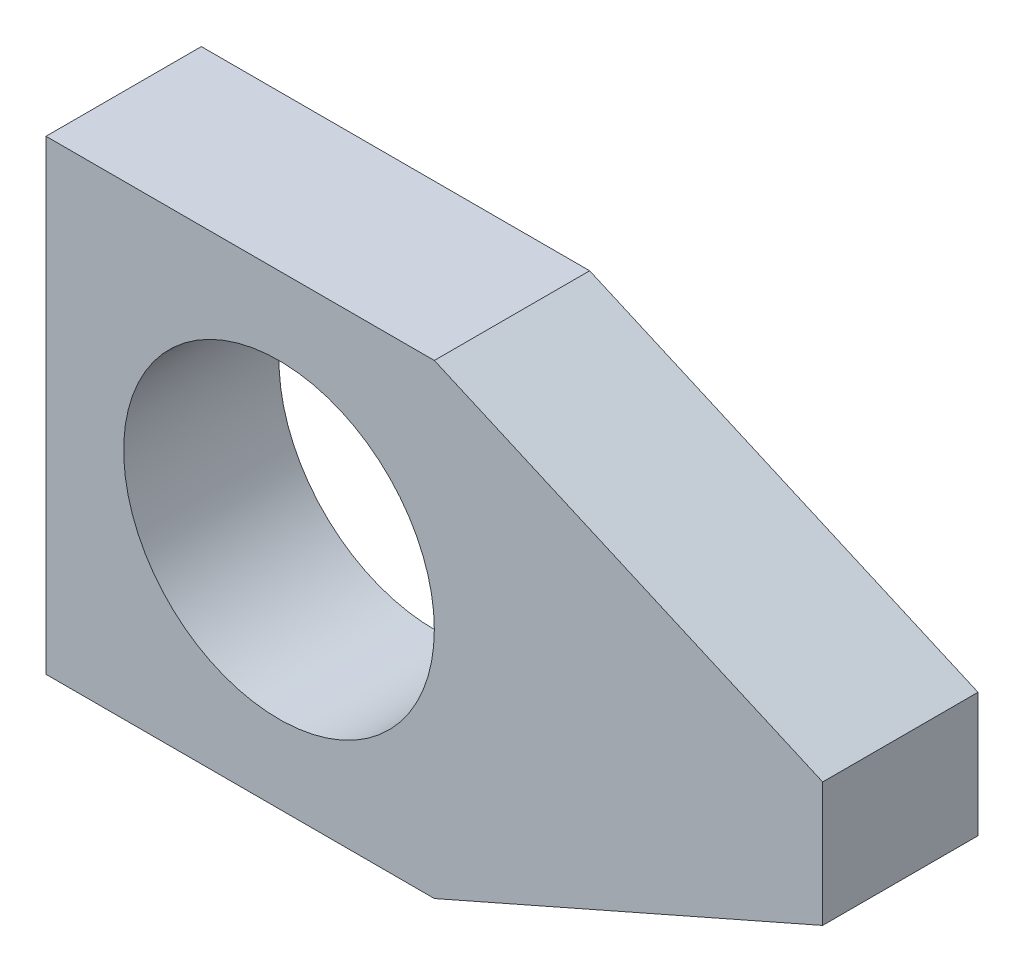
ISO-10303-21;
HEADER;
FILE_DESCRIPTION(('STEP AP214'),'2;1');
FILE_NAME('part.step','',(''),(''),'','','');
FILE_SCHEMA(('AUTOMOTIVE_DESIGN { 1 0 10303 214 1 1 1 1 }'));
ENDSEC;
DATA;
#1=APPLICATION_CONTEXT('core data for automotive mechanical design processes');
#2=APPLICATION_PROTOCOL_DEFINITION('international standard','automotive_design',2000,#1);
#3=PRODUCT_CONTEXT('',#1,'mechanical');
#4=PRODUCT('Part','Part','',(#3));
#5=PRODUCT_RELATED_PRODUCT_CATEGORY('part','',(#4));
#6=PRODUCT_DEFINITION_FORMATION('','',#4);
#7=PRODUCT_DEFINITION_CONTEXT('part definition',#1,'design');
#8=PRODUCT_DEFINITION('design','',#6,#7);
#9=PRODUCT_DEFINITION_SHAPE('','',#8);
#10=(LENGTH_UNIT() NAMED_UNIT(*) SI_UNIT(.MILLI.,.METRE.));
#11=(NAMED_UNIT(*) PLANE_ANGLE_UNIT() SI_UNIT($,.RADIAN.));
#12=(NAMED_UNIT(*) SI_UNIT($,.STERADIAN.) SOLID_ANGLE_UNIT());
#13=UNCERTAINTY_MEASURE_WITH_UNIT(LENGTH_MEASURE(1.E-05),#10,'distance_accuracy_value','');
#14=(GEOMETRIC_REPRESENTATION_CONTEXT(3) GLOBAL_UNCERTAINTY_ASSIGNED_CONTEXT((#13)) GLOBAL_UNIT_ASSIGNED_CONTEXT((#10,
#11,#12)) REPRESENTATION_CONTEXT('',''));
#15=CARTESIAN_POINT('',(0.,0.,0.));
#16=DIRECTION('',(0.,0.,1.));
#17=DIRECTION('',(1.,0.,0.));
#18=AXIS2_PLACEMENT_3D('',#15,#16,#17);
#19=CARTESIAN_POINT('',(0.,0.,10.));
#20=DIRECTION('',(0.,0.,1.));
#21=DIRECTION('',(1.,0.,0.));
#22=AXIS2_PLACEMENT_3D('',#19,#20,#21);
#23=PLANE('',#22);
#24=DIRECTION('',(0.,-1.,0.));
#25=VECTOR('',#24,1.);
#26=CARTESIAN_POINT('',(-15.,15.,10.));
#27=LINE('',#26,#25);
#28=CARTESIAN_POINT('',(-15.,15.,10.));
#29=VERTEX_POINT('',#28);
#30=CARTESIAN_POINT('',(-15.,-15.,10.));
#31=VERTEX_POINT('',#30);
#32=EDGE_CURVE('E146',#29,#31,#27,.T.);
#33=ORIENTED_EDGE('',*,*,#32,.T.);
#34=DIRECTION('',(1.,0.,0.));
#35=VECTOR('',#34,1.);
#36=CARTESIAN_POINT('',(-15.,-15.,10.));
#37=LINE('',#36,#35);
#38=CARTESIAN_POINT('',(10.,-15.,10.));
#39=VERTEX_POINT('',#38);
#40=EDGE_CURVE('E94',#31,#39,#37,.T.);
#41=ORIENTED_EDGE('',*,*,#40,.T.);
#42=DIRECTION('',(0.915315032422765,0.402738614266017,0.));
#43=VECTOR('',#42,1.);
#44=CARTESIAN_POINT('',(10.,-15.,10.));
#45=LINE('',#44,#43);
#46=CARTESIAN_POINT('',(35.,-4.,10.));
#47=VERTEX_POINT('',#46);
#48=EDGE_CURVE('E107',#39,#47,#45,.T.);
#49=ORIENTED_EDGE('',*,*,#48,.T.);
#50=DIRECTION('',(0.,1.,0.));
#51=VECTOR('',#50,1.);
#52=CARTESIAN_POINT('',(35.,4.,10.));
#53=LINE('',#52,#51);
#54=CARTESIAN_POINT('',(35.,4.,10.));
#55=VERTEX_POINT('',#54);
#56=EDGE_CURVE('E101',#47,#55,#53,.T.);
#57=ORIENTED_EDGE('',*,*,#56,.T.);
#58=DIRECTION('',(-0.915315032422765,0.402738614266017,0.));
#59=VECTOR('',#58,1.);
#60=CARTESIAN_POINT('',(10.,15.,10.));
#61=LINE('',#60,#59);
#62=CARTESIAN_POINT('',(10.,15.,10.));
#63=VERTEX_POINT('',#62);
#64=EDGE_CURVE('E105',#55,#63,#61,.T.);
#65=ORIENTED_EDGE('',*,*,#64,.T.);
#66=DIRECTION('',(-1.,0.,0.));
#67=VECTOR('',#66,1.);
#68=CARTESIAN_POINT('',(-15.,15.,10.));
#69=LINE('',#68,#67);
#70=EDGE_CURVE('E57',#63,#29,#69,.T.);
#71=ORIENTED_EDGE('',*,*,#70,.T.);
#72=EDGE_LOOP('',(#33,#41,#49,#57,#65,#71));
#73=FACE_BOUND('',#72,.T.);
#74=CARTESIAN_POINT('',(0.,0.,10.));
#75=DIRECTION('',(0.,0.,1.));
#76=DIRECTION('',(1.,0.,0.));
#77=AXIS2_PLACEMENT_3D('',#74,#75,#76);
#78=CIRCLE('',#77,10.);
#79=CARTESIAN_POINT('',(10.,0.,10.));
#80=VERTEX_POINT('',#79);
#81=EDGE_CURVE('E134',#80,#80,#78,.T.);
#82=ORIENTED_EDGE('',*,*,#81,.F.);
#83=EDGE_LOOP('',(#82));
#84=FACE_BOUND('',#83,.T.);
#85=ADVANCED_FACE('F39',(#73,#84),#23,.T.);
#86=CARTESIAN_POINT('',(0.,0.,0.));
#87=DIRECTION('',(0.,0.,1.));
#88=DIRECTION('',(1.,0.,0.));
#89=AXIS2_PLACEMENT_3D('',#86,#87,#88);
#90=PLANE('',#89);
#91=DIRECTION('',(0.,-1.,0.));
#92=VECTOR('',#91,1.);
#93=CARTESIAN_POINT('',(-15.,15.,0.));
#94=LINE('',#93,#92);
#95=CARTESIAN_POINT('',(-15.,15.,0.));
#96=VERTEX_POINT('',#95);
#97=CARTESIAN_POINT('',(-15.,-15.,0.));
#98=VERTEX_POINT('',#97);
#99=EDGE_CURVE('E129',#96,#98,#94,.T.);
#100=ORIENTED_EDGE('',*,*,#99,.F.);
#101=DIRECTION('',(-1.,0.,0.));
#102=VECTOR('',#101,1.);
#103=CARTESIAN_POINT('',(-15.,15.,0.));
#104=LINE('',#103,#102);
#105=CARTESIAN_POINT('',(10.,15.,0.));
#106=VERTEX_POINT('',#105);
#107=EDGE_CURVE('E86',#106,#96,#104,.T.);
#108=ORIENTED_EDGE('',*,*,#107,.F.);
#109=DIRECTION('',(-0.915315032422765,0.402738614266017,0.));
#110=VECTOR('',#109,1.);
#111=CARTESIAN_POINT('',(10.,15.,0.));
#112=LINE('',#111,#110);
#113=CARTESIAN_POINT('',(35.,4.,0.));
#114=VERTEX_POINT('',#113);
#115=EDGE_CURVE('E80',#114,#106,#112,.T.);
#116=ORIENTED_EDGE('',*,*,#115,.F.);
#117=DIRECTION('',(0.,1.,0.));
#118=VECTOR('',#117,1.);
#119=CARTESIAN_POINT('',(35.,4.,0.));
#120=LINE('',#119,#118);
#121=CARTESIAN_POINT('',(35.,-4.,0.));
#122=VERTEX_POINT('',#121);
#123=EDGE_CURVE('E116',#122,#114,#120,.T.);
#124=ORIENTED_EDGE('',*,*,#123,.F.);
#125=DIRECTION('',(0.915315032422765,0.402738614266017,0.));
#126=VECTOR('',#125,1.);
#127=CARTESIAN_POINT('',(10.,-15.,0.));
#128=LINE('',#127,#126);
#129=CARTESIAN_POINT('',(10.,-15.,0.));
#130=VERTEX_POINT('',#129);
#131=EDGE_CURVE('E137',#130,#122,#128,.T.);
#132=ORIENTED_EDGE('',*,*,#131,.F.);
#133=DIRECTION('',(1.,0.,0.));
#134=VECTOR('',#133,1.);
#135=CARTESIAN_POINT('',(-15.,-15.,0.));
#136=LINE('',#135,#134);
#137=EDGE_CURVE('E133',#98,#130,#136,.T.);
#138=ORIENTED_EDGE('',*,*,#137,.F.);
#139=EDGE_LOOP('',(#100,#108,#116,#124,#132,#138));
#140=FACE_BOUND('',#139,.T.);
#141=CARTESIAN_POINT('',(0.,0.,0.));
#142=DIRECTION('',(0.,0.,1.));
#143=DIRECTION('',(1.,0.,0.));
#144=AXIS2_PLACEMENT_3D('',#141,#142,#143);
#145=CIRCLE('',#144,10.);
#146=CARTESIAN_POINT('',(10.,0.,0.));
#147=VERTEX_POINT('',#146);
#148=EDGE_CURVE('E243',#147,#147,#145,.T.);
#149=ORIENTED_EDGE('',*,*,#148,.T.);
#150=EDGE_LOOP('',(#149));
#151=FACE_BOUND('',#150,.T.);
#152=ADVANCED_FACE('F159',(#140,#151),#90,.F.);
#153=CARTESIAN_POINT('',(-15.,15.,10.));
#154=DIRECTION('',(1.,0.,0.));
#155=DIRECTION('',(0.,0.,-1.));
#156=AXIS2_PLACEMENT_3D('',#153,#154,#155);
#157=PLANE('',#156);
#158=ORIENTED_EDGE('',*,*,#99,.T.);
#159=DIRECTION('',(0.,0.,-1.));
#160=VECTOR('',#159,1.);
#161=CARTESIAN_POINT('',(-15.,-15.,10.));
#162=LINE('',#161,#160);
#163=EDGE_CURVE('E11',#31,#98,#162,.T.);
#164=ORIENTED_EDGE('',*,*,#163,.F.);
#165=ORIENTED_EDGE('',*,*,#32,.F.);
#166=DIRECTION('',(0.,0.,-1.));
#167=VECTOR('',#166,1.);
#168=CARTESIAN_POINT('',(-15.,15.,10.));
#169=LINE('',#168,#167);
#170=EDGE_CURVE('E125',#29,#96,#169,.T.);
#171=ORIENTED_EDGE('',*,*,#170,.T.);
#172=EDGE_LOOP('',(#158,#164,#165,#171));
#173=FACE_BOUND('',#172,.T.);
#174=ADVANCED_FACE('F41',(#173),#157,.F.);
#175=CARTESIAN_POINT('',(-15.,-15.,10.));
#176=DIRECTION('',(0.,1.,0.));
#177=DIRECTION('',(0.,0.,1.));
#178=AXIS2_PLACEMENT_3D('',#175,#176,#177);
#179=PLANE('',#178);
#180=ORIENTED_EDGE('',*,*,#137,.T.);
#181=DIRECTION('',(0.,0.,-1.));
#182=VECTOR('',#181,1.);
#183=CARTESIAN_POINT('',(10.,-15.,10.));
#184=LINE('',#183,#182);
#185=EDGE_CURVE('E49',#39,#130,#184,.T.);
#186=ORIENTED_EDGE('',*,*,#185,.F.);
#187=ORIENTED_EDGE('',*,*,#40,.F.);
#188=ORIENTED_EDGE('',*,*,#163,.T.);
#189=EDGE_LOOP('',(#180,#186,#187,#188));
#190=FACE_BOUND('',#189,.T.);
#191=ADVANCED_FACE('F184',(#190),#179,.F.);
#192=CARTESIAN_POINT('',(10.,-15.,10.));
#193=DIRECTION('',(-0.402738614266017,0.915315032422766,0.));
#194=DIRECTION('',(-0.915315032422766,-0.402738614266017,0.));
#195=AXIS2_PLACEMENT_3D('',#192,#193,#194);
#196=PLANE('',#195);
#197=ORIENTED_EDGE('',*,*,#131,.T.);
#198=DIRECTION('',(0.,0.,-1.));
#199=VECTOR('',#198,1.);
#200=CARTESIAN_POINT('',(35.,-4.,10.));
#201=LINE('',#200,#199);
#202=EDGE_CURVE('E118',#47,#122,#201,.T.);
#203=ORIENTED_EDGE('',*,*,#202,.F.);
#204=ORIENTED_EDGE('',*,*,#48,.F.);
#205=ORIENTED_EDGE('',*,*,#185,.T.);
#206=EDGE_LOOP('',(#197,#203,#204,#205));
#207=FACE_BOUND('',#206,.T.);
#208=ADVANCED_FACE('F156',(#207),#196,.F.);
#209=CARTESIAN_POINT('',(35.,4.,10.));
#210=DIRECTION('',(-1.,0.,0.));
#211=DIRECTION('',(0.,0.,1.));
#212=AXIS2_PLACEMENT_3D('',#209,#210,#211);
#213=PLANE('',#212);
#214=ORIENTED_EDGE('',*,*,#123,.T.);
#215=DIRECTION('',(0.,0.,-1.));
#216=VECTOR('',#215,1.);
#217=CARTESIAN_POINT('',(35.,4.,10.));
#218=LINE('',#217,#216);
#219=EDGE_CURVE('E113',#55,#114,#218,.T.);
#220=ORIENTED_EDGE('',*,*,#219,.F.);
#221=ORIENTED_EDGE('',*,*,#56,.F.);
#222=ORIENTED_EDGE('',*,*,#202,.T.);
#223=EDGE_LOOP('',(#214,#220,#221,#222));
#224=FACE_BOUND('',#223,.T.);
#225=ADVANCED_FACE('F114',(#224),#213,.F.);
#226=CARTESIAN_POINT('',(10.,15.,10.));
#227=DIRECTION('',(-0.402738614266017,-0.915315032422766,0.));
#228=DIRECTION('',(0.915315032422766,-0.402738614266017,0.));
#229=AXIS2_PLACEMENT_3D('',#226,#227,#228);
#230=PLANE('',#229);
#231=ORIENTED_EDGE('',*,*,#115,.T.);
#232=DIRECTION('',(0.,0.,-1.));
#233=VECTOR('',#232,1.);
#234=CARTESIAN_POINT('',(10.,15.,10.));
#235=LINE('',#234,#233);
#236=EDGE_CURVE('E119',#63,#106,#235,.T.);
#237=ORIENTED_EDGE('',*,*,#236,.F.);
#238=ORIENTED_EDGE('',*,*,#64,.F.);
#239=ORIENTED_EDGE('',*,*,#219,.T.);
#240=EDGE_LOOP('',(#231,#237,#238,#239));
#241=FACE_BOUND('',#240,.T.);
#242=ADVANCED_FACE('F121',(#241),#230,.F.);
#243=CARTESIAN_POINT('',(-15.,15.,10.));
#244=DIRECTION('',(0.,-1.,0.));
#245=DIRECTION('',(0.,0.,-1.));
#246=AXIS2_PLACEMENT_3D('',#243,#244,#245);
#247=PLANE('',#246);
#248=ORIENTED_EDGE('',*,*,#107,.T.);
#249=ORIENTED_EDGE('',*,*,#170,.F.);
#250=ORIENTED_EDGE('',*,*,#70,.F.);
#251=ORIENTED_EDGE('',*,*,#236,.T.);
#252=EDGE_LOOP('',(#248,#249,#250,#251));
#253=FACE_BOUND('',#252,.T.);
#254=ADVANCED_FACE('F164',(#253),#247,.F.);
#255=CARTESIAN_POINT('',(0.,0.,10.));
#256=DIRECTION('',(0.,0.,-1.));
#257=DIRECTION('',(-1.,0.,0.));
#258=AXIS2_PLACEMENT_3D('',#255,#256,#257);
#259=CYLINDRICAL_SURFACE('',#258,10.);
#260=ORIENTED_EDGE('',*,*,#81,.T.);
#261=EDGE_LOOP('',(#260));
#262=FACE_BOUND('',#261,.T.);
#263=ORIENTED_EDGE('',*,*,#148,.F.);
#264=EDGE_LOOP('',(#263));
#265=FACE_BOUND('',#264,.T.);
#266=ADVANCED_FACE('F166',(#262,#265),#259,.F.);
#267=CLOSED_SHELL('',(#85,#152,#174,#191,#208,#225,#242,#254,#266));
#268=MANIFOLD_SOLID_BREP('B2',#267);
#269=ADVANCED_BREP_SHAPE_REPRESENTATION('',(#18,#268),#14);
#270=SHAPE_DEFINITION_REPRESENTATION(#9,#269);
ENDSEC;
END-ISO-10303-21;
